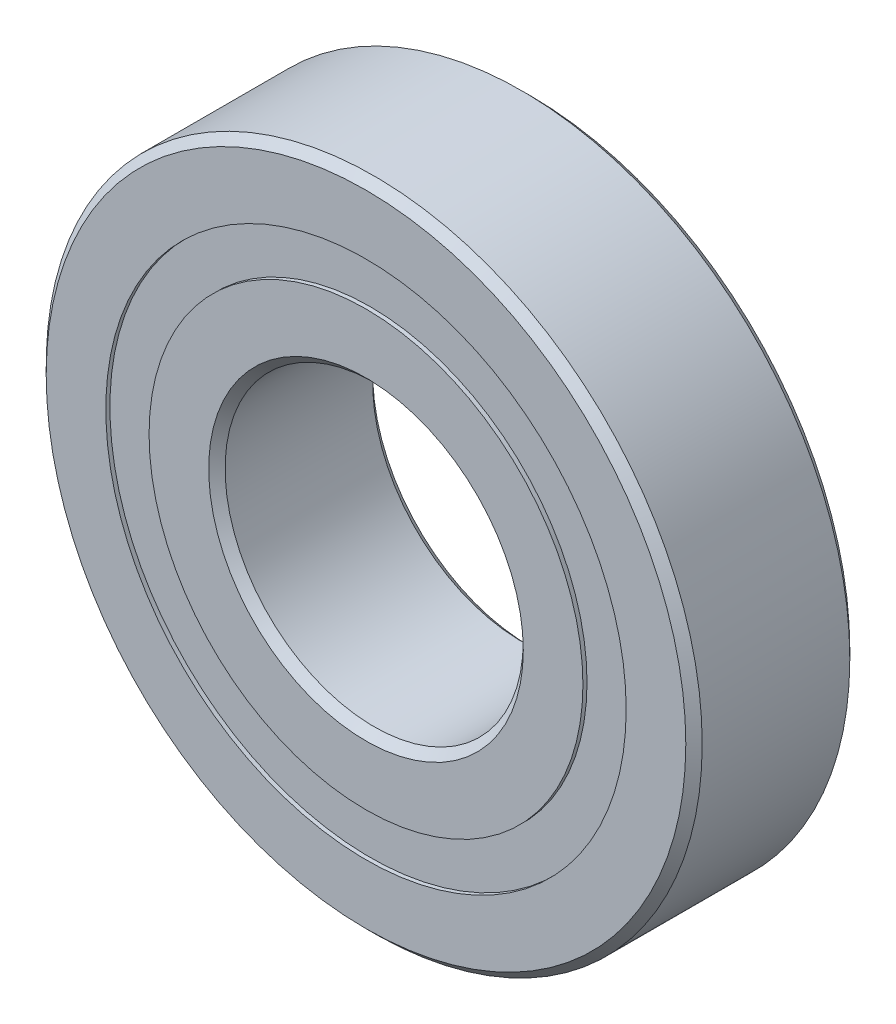
ISO-10303-21;
HEADER;
FILE_DESCRIPTION(('STEP AP214'),'2;1');
FILE_NAME('part.step','',(''),(''),'','','');
FILE_SCHEMA(('AUTOMOTIVE_DESIGN { 1 0 10303 214 1 1 1 1 }'));
ENDSEC;
DATA;
#1=APPLICATION_CONTEXT('core data for automotive mechanical design processes');
#2=APPLICATION_PROTOCOL_DEFINITION('international standard','automotive_design',2000,#1);
#3=PRODUCT_CONTEXT('',#1,'mechanical');
#4=PRODUCT('Part','Part','',(#3));
#5=PRODUCT_RELATED_PRODUCT_CATEGORY('part','',(#4));
#6=PRODUCT_DEFINITION_FORMATION('','',#4);
#7=PRODUCT_DEFINITION_CONTEXT('part definition',#1,'design');
#8=PRODUCT_DEFINITION('design','',#6,#7);
#9=PRODUCT_DEFINITION_SHAPE('','',#8);
#10=(LENGTH_UNIT() NAMED_UNIT(*) SI_UNIT(.MILLI.,.METRE.));
#11=(NAMED_UNIT(*) PLANE_ANGLE_UNIT() SI_UNIT($,.RADIAN.));
#12=(NAMED_UNIT(*) SI_UNIT($,.STERADIAN.) SOLID_ANGLE_UNIT());
#13=UNCERTAINTY_MEASURE_WITH_UNIT(LENGTH_MEASURE(1.E-05),#10,'distance_accuracy_value','');
#14=(GEOMETRIC_REPRESENTATION_CONTEXT(3) GLOBAL_UNCERTAINTY_ASSIGNED_CONTEXT((#13)) GLOBAL_UNIT_ASSIGNED_CONTEXT((#10,
#11,#12)) REPRESENTATION_CONTEXT('',''));
#15=CARTESIAN_POINT('',(0.,0.,0.));
#16=DIRECTION('',(0.,0.,1.));
#17=DIRECTION('',(1.,0.,0.));
#18=AXIS2_PLACEMENT_3D('',#15,#16,#17);
#19=CARTESIAN_POINT('',(0.,13.8513736263736,-4.14734375));
#20=DIRECTION('',(0.,0.,1.));
#21=DIRECTION('',(1.,0.,0.));
#22=AXIS2_PLACEMENT_3D('',#19,#20,#21);
#23=PLANE('',#22);
#24=CARTESIAN_POINT('',(0.,0.,-4.14734375));
#25=DIRECTION('',(0.,0.,1.));
#26=DIRECTION('',(1.,0.,0.));
#27=AXIS2_PLACEMENT_3D('',#24,#25,#26);
#28=CIRCLE('',#27,13.8513736263736);
#29=CARTESIAN_POINT('',(13.8513736263736,0.,-4.14734375));
#30=VERTEX_POINT('',#29);
#31=EDGE_CURVE('E59',#30,#30,#28,.T.);
#32=ORIENTED_EDGE('',*,*,#31,.F.);
#33=EDGE_LOOP('',(#32));
#34=FACE_BOUND('',#33,.T.);
#35=CARTESIAN_POINT('',(0.,0.,-4.14734375));
#36=DIRECTION('',(0.,0.,1.));
#37=DIRECTION('',(1.,0.,0.));
#38=AXIS2_PLACEMENT_3D('',#35,#36,#37);
#39=CIRCLE('',#38,11.5486263736264);
#40=CARTESIAN_POINT('',(11.5486263736264,0.,-4.14734375));
#41=VERTEX_POINT('',#40);
#42=EDGE_CURVE('E11',#41,#41,#39,.T.);
#43=ORIENTED_EDGE('',*,*,#42,.T.);
#44=EDGE_LOOP('',(#43));
#45=FACE_BOUND('',#44,.T.);
#46=ADVANCED_FACE('F45',(#34,#45),#23,.F.);
#47=CARTESIAN_POINT('',(0.,0.,4.365625));
#48=DIRECTION('',(0.,0.,1.));
#49=DIRECTION('',(1.,0.,0.));
#50=AXIS2_PLACEMENT_3D('',#47,#48,#49);
#51=CYLINDRICAL_SURFACE('',#50,11.5486263736264);
#52=ORIENTED_EDGE('',*,*,#42,.F.);
#53=EDGE_LOOP('',(#52));
#54=FACE_BOUND('',#53,.T.);
#55=CARTESIAN_POINT('',(0.,0.,-2.25617798111032));
#56=DIRECTION('',(0.,0.,1.));
#57=DIRECTION('',(1.,0.,0.));
#58=AXIS2_PLACEMENT_3D('',#55,#56,#57);
#59=CIRCLE('',#58,11.5486263736264);
#60=CARTESIAN_POINT('',(11.5486263736264,0.,-2.25617798111032));
#61=VERTEX_POINT('',#60);
#62=EDGE_CURVE('E51',#61,#61,#59,.T.);
#63=ORIENTED_EDGE('',*,*,#62,.T.);
#64=EDGE_LOOP('',(#63));
#65=FACE_BOUND('',#64,.T.);
#66=ADVANCED_FACE('F68',(#54,#65),#51,.F.);
#67=CARTESIAN_POINT('',(0.,13.8513736263736,-2.25617798111032));
#68=DIRECTION('',(0.,0.,-1.));
#69=DIRECTION('',(-1.,0.,0.));
#70=AXIS2_PLACEMENT_3D('',#67,#68,#69);
#71=PLANE('',#70);
#72=ORIENTED_EDGE('',*,*,#62,.F.);
#73=EDGE_LOOP('',(#72));
#74=FACE_BOUND('',#73,.T.);
#75=CARTESIAN_POINT('',(0.,0.,-2.25617798111032));
#76=DIRECTION('',(0.,0.,1.));
#77=DIRECTION('',(1.,0.,0.));
#78=AXIS2_PLACEMENT_3D('',#75,#76,#77);
#79=CIRCLE('',#78,13.8513736263736);
#80=CARTESIAN_POINT('',(13.8513736263736,0.,-2.25617798111032));
#81=VERTEX_POINT('',#80);
#82=EDGE_CURVE('E55',#81,#81,#79,.T.);
#83=ORIENTED_EDGE('',*,*,#82,.T.);
#84=EDGE_LOOP('',(#83));
#85=FACE_BOUND('',#84,.T.);
#86=ADVANCED_FACE('F72',(#74,#85),#71,.F.);
#87=CARTESIAN_POINT('',(0.,0.,4.365625));
#88=DIRECTION('',(0.,0.,1.));
#89=DIRECTION('',(1.,0.,0.));
#90=AXIS2_PLACEMENT_3D('',#87,#88,#89);
#91=CYLINDRICAL_SURFACE('',#90,13.8513736263736);
#92=ORIENTED_EDGE('',*,*,#82,.F.);
#93=EDGE_LOOP('',(#92));
#94=FACE_BOUND('',#93,.T.);
#95=ORIENTED_EDGE('',*,*,#31,.T.);
#96=EDGE_LOOP('',(#95));
#97=FACE_BOUND('',#96,.T.);
#98=ADVANCED_FACE('F65',(#94,#97),#91,.T.);
#99=CLOSED_SHELL('',(#46,#66,#86,#98));
#100=MANIFOLD_SOLID_BREP('B2',#99);
#101=CARTESIAN_POINT('',(0.,13.8513736263736,4.14734375));
#102=DIRECTION('',(0.,0.,-1.));
#103=DIRECTION('',(-1.,0.,0.));
#104=AXIS2_PLACEMENT_3D('',#101,#102,#103);
#105=PLANE('',#104);
#106=CARTESIAN_POINT('',(0.,0.,4.14734375));
#107=DIRECTION('',(0.,0.,1.));
#108=DIRECTION('',(1.,0.,0.));
#109=AXIS2_PLACEMENT_3D('',#106,#107,#108);
#110=CIRCLE('',#109,11.5486263736264);
#111=CARTESIAN_POINT('',(11.5486263736264,0.,4.14734375));
#112=VERTEX_POINT('',#111);
#113=EDGE_CURVE('E44',#112,#112,#110,.T.);
#114=ORIENTED_EDGE('',*,*,#113,.F.);
#115=EDGE_LOOP('',(#114));
#116=FACE_BOUND('',#115,.T.);
#117=CARTESIAN_POINT('',(0.,0.,4.14734375));
#118=DIRECTION('',(0.,0.,1.));
#119=DIRECTION('',(1.,0.,0.));
#120=AXIS2_PLACEMENT_3D('',#117,#118,#119);
#121=CIRCLE('',#120,13.8513736263736);
#122=CARTESIAN_POINT('',(13.8513736263736,0.,4.14734375));
#123=VERTEX_POINT('',#122);
#124=EDGE_CURVE('E126',#123,#123,#121,.T.);
#125=ORIENTED_EDGE('',*,*,#124,.T.);
#126=EDGE_LOOP('',(#125));
#127=FACE_BOUND('',#126,.T.);
#128=ADVANCED_FACE('F112',(#116,#127),#105,.F.);
#129=CARTESIAN_POINT('',(0.,0.,4.365625));
#130=DIRECTION('',(0.,0.,1.));
#131=DIRECTION('',(1.,0.,0.));
#132=AXIS2_PLACEMENT_3D('',#129,#130,#131);
#133=CYLINDRICAL_SURFACE('',#132,11.5486263736264);
#134=CARTESIAN_POINT('',(0.,0.,2.25617798111032));
#135=DIRECTION('',(0.,0.,1.));
#136=DIRECTION('',(1.,0.,0.));
#137=AXIS2_PLACEMENT_3D('',#134,#135,#136);
#138=CIRCLE('',#137,11.5486263736264);
#139=CARTESIAN_POINT('',(11.5486263736264,0.,2.25617798111032));
#140=VERTEX_POINT('',#139);
#141=EDGE_CURVE('E118',#140,#140,#138,.T.);
#142=ORIENTED_EDGE('',*,*,#141,.F.);
#143=EDGE_LOOP('',(#142));
#144=FACE_BOUND('',#143,.T.);
#145=ORIENTED_EDGE('',*,*,#113,.T.);
#146=EDGE_LOOP('',(#145));
#147=FACE_BOUND('',#146,.T.);
#148=ADVANCED_FACE('F141',(#144,#147),#133,.F.);
#149=CARTESIAN_POINT('',(0.,13.8513736263736,2.25617798111032));
#150=DIRECTION('',(0.,0.,1.));
#151=DIRECTION('',(1.,0.,0.));
#152=AXIS2_PLACEMENT_3D('',#149,#150,#151);
#153=PLANE('',#152);
#154=CARTESIAN_POINT('',(0.,0.,2.25617798111032));
#155=DIRECTION('',(0.,0.,1.));
#156=DIRECTION('',(1.,0.,0.));
#157=AXIS2_PLACEMENT_3D('',#154,#155,#156);
#158=CIRCLE('',#157,13.8513736263736);
#159=CARTESIAN_POINT('',(13.8513736263736,0.,2.25617798111032));
#160=VERTEX_POINT('',#159);
#161=EDGE_CURVE('E122',#160,#160,#158,.T.);
#162=ORIENTED_EDGE('',*,*,#161,.F.);
#163=EDGE_LOOP('',(#162));
#164=FACE_BOUND('',#163,.T.);
#165=ORIENTED_EDGE('',*,*,#141,.T.);
#166=EDGE_LOOP('',(#165));
#167=FACE_BOUND('',#166,.T.);
#168=ADVANCED_FACE('F136',(#164,#167),#153,.F.);
#169=CARTESIAN_POINT('',(0.,0.,4.365625));
#170=DIRECTION('',(0.,0.,1.));
#171=DIRECTION('',(1.,0.,0.));
#172=AXIS2_PLACEMENT_3D('',#169,#170,#171);
#173=CYLINDRICAL_SURFACE('',#172,13.8513736263736);
#174=ORIENTED_EDGE('',*,*,#124,.F.);
#175=EDGE_LOOP('',(#174));
#176=FACE_BOUND('',#175,.T.);
#177=ORIENTED_EDGE('',*,*,#161,.T.);
#178=EDGE_LOOP('',(#177));
#179=FACE_BOUND('',#178,.T.);
#180=ADVANCED_FACE('F133',(#176,#179),#173,.T.);
#181=CLOSED_SHELL('',(#128,#148,#168,#180));
#182=MANIFOLD_SOLID_BREP('B6',#181);
#183=CARTESIAN_POINT('',(-7.46487270411427,10.2745158285619,0.));
#184=DIRECTION('',(0.,0.,1.));
#185=DIRECTION('',(-0.587785252292462,0.809016994374955,0.));
#186=AXIS2_PLACEMENT_3D('',#183,#184,#185);
#187=SPHERICAL_SURFACE('',#186,2.25617798111032);
#188=CARTESIAN_POINT('',(-7.46487270411427,10.2745158285619,2.25617798111032));
#189=VERTEX_POINT('',#188);
#190=VERTEX_LOOP('',#189);
#191=FACE_BOUND('',#190,.T.);
#192=ADVANCED_FACE('F179',(#191),#187,.T.);
#193=CLOSED_SHELL('',(#192));
#194=MANIFOLD_SOLID_BREP('B39',#193);
#195=CARTESIAN_POINT('',(-12.0784177569484,3.92451582856197,0.));
#196=DIRECTION('',(0.,0.,1.));
#197=DIRECTION('',(-0.95105651629515,0.309016994374958,0.));
#198=AXIS2_PLACEMENT_3D('',#195,#196,#197);
#199=SPHERICAL_SURFACE('',#198,2.25617798111032);
#200=CARTESIAN_POINT('',(-12.0784177569484,3.92451582856197,2.25617798111032));
#201=VERTEX_POINT('',#200);
#202=VERTEX_LOOP('',#201);
#203=FACE_BOUND('',#202,.T.);
#204=ADVANCED_FACE('F199',(#203),#199,.T.);
#205=CLOSED_SHELL('',(#204));
#206=MANIFOLD_SOLID_BREP('B108',#205);
#207=CARTESIAN_POINT('',(-12.0784177569485,-3.92451582856172,0.));
#208=DIRECTION('',(0.,0.,1.));
#209=DIRECTION('',(-0.951056516295157,-0.309016994374938,0.));
#210=AXIS2_PLACEMENT_3D('',#207,#208,#209);
#211=SPHERICAL_SURFACE('',#210,2.25617798111032);
#212=CARTESIAN_POINT('',(-12.0784177569485,-3.92451582856172,2.25617798111032));
#213=VERTEX_POINT('',#212);
#214=VERTEX_LOOP('',#213);
#215=FACE_BOUND('',#214,.T.);
#216=ADVANCED_FACE('F219',(#215),#211,.T.);
#217=CLOSED_SHELL('',(#216));
#218=MANIFOLD_SOLID_BREP('B175',#217);
#219=CARTESIAN_POINT('',(-7.4648727041145,-10.2745158285618,0.));
#220=DIRECTION('',(0.,0.,1.));
#221=DIRECTION('',(-0.58778525229248,-0.809016994374942,0.));
#222=AXIS2_PLACEMENT_3D('',#219,#220,#221);
#223=SPHERICAL_SURFACE('',#222,2.25617798111032);
#224=CARTESIAN_POINT('',(-7.4648727041145,-10.2745158285618,2.25617798111032));
#225=VERTEX_POINT('',#224);
#226=VERTEX_LOOP('',#225);
#227=FACE_BOUND('',#226,.T.);
#228=ADVANCED_FACE('F239',(#227),#223,.T.);
#229=CLOSED_SHELL('',(#228));
#230=MANIFOLD_SOLID_BREP('B195',#229);
#231=CARTESIAN_POINT('',(0.,-12.7,0.));
#232=DIRECTION('',(0.,0.,1.));
#233=DIRECTION('',(0.,-1.,0.));
#234=AXIS2_PLACEMENT_3D('',#231,#232,#233);
#235=SPHERICAL_SURFACE('',#234,2.25617798111032);
#236=CARTESIAN_POINT('',(0.,-12.7,2.25617798111032));
#237=VERTEX_POINT('',#236);
#238=VERTEX_LOOP('',#237);
#239=FACE_BOUND('',#238,.T.);
#240=ADVANCED_FACE('F259',(#239),#235,.T.);
#241=CLOSED_SHELL('',(#240));
#242=MANIFOLD_SOLID_BREP('B215',#241);
#243=CARTESIAN_POINT('',(7.46487270411435,-10.2745158285619,0.));
#244=DIRECTION('',(0.,0.,1.));
#245=DIRECTION('',(0.587785252292469,-0.809016994374951,0.));
#246=AXIS2_PLACEMENT_3D('',#243,#244,#245);
#247=SPHERICAL_SURFACE('',#246,2.25617798111032);
#248=CARTESIAN_POINT('',(7.46487270411435,-10.2745158285619,2.25617798111032));
#249=VERTEX_POINT('',#248);
#250=VERTEX_LOOP('',#249);
#251=FACE_BOUND('',#250,.T.);
#252=ADVANCED_FACE('F279',(#251),#247,.T.);
#253=CLOSED_SHELL('',(#252));
#254=MANIFOLD_SOLID_BREP('B235',#253);
#255=CARTESIAN_POINT('',(12.0784177569484,-3.92451582856189,0.));
#256=DIRECTION('',(0.,0.,1.));
#257=DIRECTION('',(0.951056516295152,-0.309016994374952,0.));
#258=AXIS2_PLACEMENT_3D('',#255,#256,#257);
#259=SPHERICAL_SURFACE('',#258,2.25617798111032);
#260=CARTESIAN_POINT('',(12.0784177569484,-3.92451582856189,2.25617798111032));
#261=VERTEX_POINT('',#260);
#262=VERTEX_LOOP('',#261);
#263=FACE_BOUND('',#262,.T.);
#264=ADVANCED_FACE('F299',(#263),#259,.T.);
#265=CLOSED_SHELL('',(#264));
#266=MANIFOLD_SOLID_BREP('B255',#265);
#267=CARTESIAN_POINT('',(12.0784177569485,3.9245158285618,0.));
#268=DIRECTION('',(0.,0.,1.));
#269=DIRECTION('',(0.951056516295155,0.309016994374945,0.));
#270=AXIS2_PLACEMENT_3D('',#267,#268,#269);
#271=SPHERICAL_SURFACE('',#270,2.25617798111032);
#272=CARTESIAN_POINT('',(12.0784177569485,3.9245158285618,2.25617798111032));
#273=VERTEX_POINT('',#272);
#274=VERTEX_LOOP('',#273);
#275=FACE_BOUND('',#274,.T.);
#276=ADVANCED_FACE('F319',(#275),#271,.T.);
#277=CLOSED_SHELL('',(#276));
#278=MANIFOLD_SOLID_BREP('B275',#277);
#279=CARTESIAN_POINT('',(7.46487270411442,10.2745158285618,0.));
#280=DIRECTION('',(0.,0.,1.));
#281=DIRECTION('',(0.587785252292474,0.809016994374947,0.));
#282=AXIS2_PLACEMENT_3D('',#279,#280,#281);
#283=SPHERICAL_SURFACE('',#282,2.25617798111032);
#284=CARTESIAN_POINT('',(7.46487270411442,10.2745158285618,2.25617798111032));
#285=VERTEX_POINT('',#284);
#286=VERTEX_LOOP('',#285);
#287=FACE_BOUND('',#286,.T.);
#288=ADVANCED_FACE('F339',(#287),#283,.T.);
#289=CLOSED_SHELL('',(#288));
#290=MANIFOLD_SOLID_BREP('B295',#289);
#291=CARTESIAN_POINT('',(0.,12.7,0.));
#292=DIRECTION('',(0.,0.,1.));
#293=DIRECTION('',(0.,1.,0.));
#294=AXIS2_PLACEMENT_3D('',#291,#292,#293);
#295=SPHERICAL_SURFACE('',#294,2.25617798111032);
#296=CARTESIAN_POINT('',(0.,12.7,2.25617798111032));
#297=VERTEX_POINT('',#296);
#298=VERTEX_LOOP('',#297);
#299=FACE_BOUND('',#298,.T.);
#300=ADVANCED_FACE('F361',(#299),#295,.T.);
#301=CLOSED_SHELL('',(#300));
#302=MANIFOLD_SOLID_BREP('B315',#301);
#303=CARTESIAN_POINT('',(0.,11.5486263736264,4.365625));
#304=DIRECTION('',(0.,0.,-1.));
#305=DIRECTION('',(-1.,0.,0.));
#306=AXIS2_PLACEMENT_3D('',#303,#304,#305);
#307=PLANE('',#306);
#308=CARTESIAN_POINT('',(0.,0.,4.365625));
#309=DIRECTION('',(0.,0.,1.));
#310=DIRECTION('',(1.,0.,0.));
#311=AXIS2_PLACEMENT_3D('',#308,#309,#310);
#312=CIRCLE('',#311,8.3740625);
#313=CARTESIAN_POINT('',(8.3740625,0.,4.365625));
#314=VERTEX_POINT('',#313);
#315=EDGE_CURVE('E408',#314,#314,#312,.T.);
#316=ORIENTED_EDGE('',*,*,#315,.F.);
#317=EDGE_LOOP('',(#316));
#318=FACE_BOUND('',#317,.T.);
#319=CARTESIAN_POINT('',(0.,0.,4.365625));
#320=DIRECTION('',(0.,0.,1.));
#321=DIRECTION('',(1.,0.,0.));
#322=AXIS2_PLACEMENT_3D('',#319,#320,#321);
#323=CIRCLE('',#322,11.5486263736264);
#324=CARTESIAN_POINT('',(11.5486263736264,0.,4.365625));
#325=VERTEX_POINT('',#324);
#326=EDGE_CURVE('E360',#325,#325,#323,.T.);
#327=ORIENTED_EDGE('',*,*,#326,.T.);
#328=EDGE_LOOP('',(#327));
#329=FACE_BOUND('',#328,.T.);
#330=ADVANCED_FACE('F380',(#318,#329),#307,.F.);
#331=CARTESIAN_POINT('',(0.,0.,4.365625));
#332=DIRECTION('',(0.,0.,1.));
#333=DIRECTION('',(1.,0.,0.));
#334=AXIS2_PLACEMENT_3D('',#331,#332,#333);
#335=CYLINDRICAL_SURFACE('',#334,11.5486263736264);
#336=ORIENTED_EDGE('',*,*,#326,.F.);
#337=EDGE_LOOP('',(#336));
#338=FACE_BOUND('',#337,.T.);
#339=CARTESIAN_POINT('',(0.,0.,1.94027777777778));
#340=DIRECTION('',(0.,0.,1.));
#341=DIRECTION('',(1.,0.,0.));
#342=AXIS2_PLACEMENT_3D('',#339,#340,#341);
#343=CIRCLE('',#342,11.5486263736264);
#344=CARTESIAN_POINT('',(11.5486263736264,0.,1.94027777777778));
#345=VERTEX_POINT('',#344);
#346=EDGE_CURVE('E386',#345,#345,#343,.T.);
#347=ORIENTED_EDGE('',*,*,#346,.T.);
#348=EDGE_LOOP('',(#347));
#349=FACE_BOUND('',#348,.T.);
#350=ADVANCED_FACE('F415',(#338,#349),#335,.T.);
#351=CARTESIAN_POINT('',(0.,0.,0.));
#352=DIRECTION('',(0.,0.,1.));
#353=DIRECTION('',(1.,0.,0.));
#354=AXIS2_PLACEMENT_3D('',#351,#352,#353);
#355=TOROIDAL_SURFACE('',#354,12.7,2.25617798111031);
#356=ORIENTED_EDGE('',*,*,#346,.F.);
#357=EDGE_LOOP('',(#356));
#358=FACE_BOUND('',#357,.T.);
#359=CARTESIAN_POINT('',(0.,0.,-1.94027777777778));
#360=DIRECTION('',(0.,0.,1.));
#361=DIRECTION('',(1.,0.,0.));
#362=AXIS2_PLACEMENT_3D('',#359,#360,#361);
#363=CIRCLE('',#362,11.5486263736264);
#364=CARTESIAN_POINT('',(11.5486263736264,0.,-1.94027777777778));
#365=VERTEX_POINT('',#364);
#366=EDGE_CURVE('E390',#365,#365,#363,.T.);
#367=ORIENTED_EDGE('',*,*,#366,.T.);
#368=EDGE_LOOP('',(#367));
#369=FACE_BOUND('',#368,.T.);
#370=ADVANCED_FACE('F419',(#358,#369),#355,.F.);
#371=CARTESIAN_POINT('',(0.,0.,4.365625));
#372=DIRECTION('',(0.,0.,1.));
#373=DIRECTION('',(1.,0.,0.));
#374=AXIS2_PLACEMENT_3D('',#371,#372,#373);
#375=CYLINDRICAL_SURFACE('',#374,11.5486263736264);
#376=ORIENTED_EDGE('',*,*,#366,.F.);
#377=EDGE_LOOP('',(#376));
#378=FACE_BOUND('',#377,.T.);
#379=CARTESIAN_POINT('',(0.,0.,-4.365625));
#380=DIRECTION('',(0.,0.,1.));
#381=DIRECTION('',(1.,0.,0.));
#382=AXIS2_PLACEMENT_3D('',#379,#380,#381);
#383=CIRCLE('',#382,11.5486263736264);
#384=CARTESIAN_POINT('',(11.5486263736264,0.,-4.365625));
#385=VERTEX_POINT('',#384);
#386=EDGE_CURVE('E394',#385,#385,#383,.T.);
#387=ORIENTED_EDGE('',*,*,#386,.T.);
#388=EDGE_LOOP('',(#387));
#389=FACE_BOUND('',#388,.T.);
#390=ADVANCED_FACE('F424',(#378,#389),#375,.T.);
#391=CARTESIAN_POINT('',(0.,8.3740625,-4.365625));
#392=DIRECTION('',(0.,0.,1.));
#393=DIRECTION('',(1.,0.,0.));
#394=AXIS2_PLACEMENT_3D('',#391,#392,#393);
#395=PLANE('',#394);
#396=ORIENTED_EDGE('',*,*,#386,.F.);
#397=EDGE_LOOP('',(#396));
#398=FACE_BOUND('',#397,.T.);
#399=CARTESIAN_POINT('',(0.,0.,-4.365625));
#400=DIRECTION('',(0.,0.,1.));
#401=DIRECTION('',(1.,0.,0.));
#402=AXIS2_PLACEMENT_3D('',#399,#400,#401);
#403=CIRCLE('',#402,8.3740625);
#404=CARTESIAN_POINT('',(8.3740625,0.,-4.365625));
#405=VERTEX_POINT('',#404);
#406=EDGE_CURVE('E399',#405,#405,#403,.T.);
#407=ORIENTED_EDGE('',*,*,#406,.T.);
#408=EDGE_LOOP('',(#407));
#409=FACE_BOUND('',#408,.T.);
#410=ADVANCED_FACE('F430',(#398,#409),#395,.F.);
#411=CARTESIAN_POINT('',(0.,0.,-3.9290625));
#412=DIRECTION('',(0.,0.,-1.));
#413=DIRECTION('',(-1.,0.,0.));
#414=AXIS2_PLACEMENT_3D('',#411,#412,#413);
#415=CONICAL_SURFACE('',#414,7.9375,0.785398163397446);
#416=ORIENTED_EDGE('',*,*,#406,.F.);
#417=EDGE_LOOP('',(#416));
#418=FACE_BOUND('',#417,.T.);
#419=CARTESIAN_POINT('',(0.,0.,-3.9290625));
#420=DIRECTION('',(0.,0.,1.));
#421=DIRECTION('',(1.,0.,0.));
#422=AXIS2_PLACEMENT_3D('',#419,#420,#421);
#423=CIRCLE('',#422,7.9375);
#424=CARTESIAN_POINT('',(7.9375,0.,-3.9290625));
#425=VERTEX_POINT('',#424);
#426=EDGE_CURVE('E402',#425,#425,#423,.T.);
#427=ORIENTED_EDGE('',*,*,#426,.T.);
#428=EDGE_LOOP('',(#427));
#429=FACE_BOUND('',#428,.T.);
#430=ADVANCED_FACE('F434',(#418,#429),#415,.F.);
#431=CARTESIAN_POINT('',(0.,0.,4.365625));
#432=DIRECTION('',(0.,0.,1.));
#433=DIRECTION('',(1.,0.,0.));
#434=AXIS2_PLACEMENT_3D('',#431,#432,#433);
#435=CYLINDRICAL_SURFACE('',#434,7.9375);
#436=ORIENTED_EDGE('',*,*,#426,.F.);
#437=EDGE_LOOP('',(#436));
#438=FACE_BOUND('',#437,.T.);
#439=CARTESIAN_POINT('',(0.,0.,3.9290625));
#440=DIRECTION('',(0.,0.,1.));
#441=DIRECTION('',(1.,0.,0.));
#442=AXIS2_PLACEMENT_3D('',#439,#440,#441);
#443=CIRCLE('',#442,7.9375);
#444=CARTESIAN_POINT('',(7.9375,0.,3.9290625));
#445=VERTEX_POINT('',#444);
#446=EDGE_CURVE('E405',#445,#445,#443,.T.);
#447=ORIENTED_EDGE('',*,*,#446,.T.);
#448=EDGE_LOOP('',(#447));
#449=FACE_BOUND('',#448,.T.);
#450=ADVANCED_FACE('F438',(#438,#449),#435,.F.);
#451=CARTESIAN_POINT('',(0.,0.,4.365625));
#452=DIRECTION('',(0.,0.,1.));
#453=DIRECTION('',(1.,0.,0.));
#454=AXIS2_PLACEMENT_3D('',#451,#452,#453);
#455=CONICAL_SURFACE('',#454,8.3740625,0.785398163397447);
#456=ORIENTED_EDGE('',*,*,#446,.F.);
#457=EDGE_LOOP('',(#456));
#458=FACE_BOUND('',#457,.T.);
#459=ORIENTED_EDGE('',*,*,#315,.T.);
#460=EDGE_LOOP('',(#459));
#461=FACE_BOUND('',#460,.T.);
#462=ADVANCED_FACE('F412',(#458,#461),#455,.F.);
#463=CLOSED_SHELL('',(#330,#350,#370,#390,#410,#430,#450,#462));
#464=MANIFOLD_SOLID_BREP('B335',#463);
#465=CARTESIAN_POINT('',(0.,0.,3.9290625));
#466=DIRECTION('',(0.,0.,-1.));
#467=DIRECTION('',(-1.,0.,0.));
#468=AXIS2_PLACEMENT_3D('',#465,#466,#467);
#469=CONICAL_SURFACE('',#468,17.4625,0.785398163397445);
#470=CARTESIAN_POINT('',(0.,0.,4.365625));
#471=DIRECTION('',(0.,0.,1.));
#472=DIRECTION('',(1.,0.,0.));
#473=AXIS2_PLACEMENT_3D('',#470,#471,#472);
#474=CIRCLE('',#473,17.0259375);
#475=CARTESIAN_POINT('',(17.0259375,0.,4.365625));
#476=VERTEX_POINT('',#475);
#477=EDGE_CURVE('E529',#476,#476,#474,.T.);
#478=ORIENTED_EDGE('',*,*,#477,.F.);
#479=EDGE_LOOP('',(#478));
#480=FACE_BOUND('',#479,.T.);
#481=CARTESIAN_POINT('',(0.,0.,3.9290625));
#482=DIRECTION('',(0.,0.,1.));
#483=DIRECTION('',(1.,0.,0.));
#484=AXIS2_PLACEMENT_3D('',#481,#482,#483);
#485=CIRCLE('',#484,17.4625);
#486=CARTESIAN_POINT('',(17.4625,0.,3.9290625));
#487=VERTEX_POINT('',#486);
#488=EDGE_CURVE('E379',#487,#487,#485,.T.);
#489=ORIENTED_EDGE('',*,*,#488,.T.);
#490=EDGE_LOOP('',(#489));
#491=FACE_BOUND('',#490,.T.);
#492=ADVANCED_FACE('F501',(#480,#491),#469,.T.);
#493=CARTESIAN_POINT('',(0.,0.,4.365625));
#494=DIRECTION('',(0.,0.,1.));
#495=DIRECTION('',(1.,0.,0.));
#496=AXIS2_PLACEMENT_3D('',#493,#494,#495);
#497=CYLINDRICAL_SURFACE('',#496,17.4625);
#498=ORIENTED_EDGE('',*,*,#488,.F.);
#499=EDGE_LOOP('',(#498));
#500=FACE_BOUND('',#499,.T.);
#501=CARTESIAN_POINT('',(0.,0.,-3.9290625));
#502=DIRECTION('',(0.,0.,1.));
#503=DIRECTION('',(1.,0.,0.));
#504=AXIS2_PLACEMENT_3D('',#501,#502,#503);
#505=CIRCLE('',#504,17.4625);
#506=CARTESIAN_POINT('',(17.4625,0.,-3.9290625));
#507=VERTEX_POINT('',#506);
#508=EDGE_CURVE('E507',#507,#507,#505,.T.);
#509=ORIENTED_EDGE('',*,*,#508,.T.);
#510=EDGE_LOOP('',(#509));
#511=FACE_BOUND('',#510,.T.);
#512=ADVANCED_FACE('F536',(#500,#511),#497,.T.);
#513=CARTESIAN_POINT('',(0.,0.,-4.365625));
#514=DIRECTION('',(0.,0.,1.));
#515=DIRECTION('',(1.,0.,0.));
#516=AXIS2_PLACEMENT_3D('',#513,#514,#515);
#517=CONICAL_SURFACE('',#516,17.0259375,0.785398163397446);
#518=ORIENTED_EDGE('',*,*,#508,.F.);
#519=EDGE_LOOP('',(#518));
#520=FACE_BOUND('',#519,.T.);
#521=CARTESIAN_POINT('',(0.,0.,-4.365625));
#522=DIRECTION('',(0.,0.,1.));
#523=DIRECTION('',(1.,0.,0.));
#524=AXIS2_PLACEMENT_3D('',#521,#522,#523);
#525=CIRCLE('',#524,17.0259375);
#526=CARTESIAN_POINT('',(17.0259375,0.,-4.365625));
#527=VERTEX_POINT('',#526);
#528=EDGE_CURVE('E511',#527,#527,#525,.T.);
#529=ORIENTED_EDGE('',*,*,#528,.T.);
#530=EDGE_LOOP('',(#529));
#531=FACE_BOUND('',#530,.T.);
#532=ADVANCED_FACE('F540',(#520,#531),#517,.T.);
#533=CARTESIAN_POINT('',(0.,17.0259375,-4.365625));
#534=DIRECTION('',(0.,0.,1.));
#535=DIRECTION('',(1.,0.,0.));
#536=AXIS2_PLACEMENT_3D('',#533,#534,#535);
#537=PLANE('',#536);
#538=ORIENTED_EDGE('',*,*,#528,.F.);
#539=EDGE_LOOP('',(#538));
#540=FACE_BOUND('',#539,.T.);
#541=CARTESIAN_POINT('',(0.,0.,-4.365625));
#542=DIRECTION('',(0.,0.,1.));
#543=DIRECTION('',(1.,0.,0.));
#544=AXIS2_PLACEMENT_3D('',#541,#542,#543);
#545=CIRCLE('',#544,13.8513736263736);
#546=CARTESIAN_POINT('',(13.8513736263736,0.,-4.365625));
#547=VERTEX_POINT('',#546);
#548=EDGE_CURVE('E515',#547,#547,#545,.T.);
#549=ORIENTED_EDGE('',*,*,#548,.T.);
#550=EDGE_LOOP('',(#549));
#551=FACE_BOUND('',#550,.T.);
#552=ADVANCED_FACE('F545',(#540,#551),#537,.F.);
#553=CARTESIAN_POINT('',(0.,0.,4.365625));
#554=DIRECTION('',(0.,0.,1.));
#555=DIRECTION('',(1.,0.,0.));
#556=AXIS2_PLACEMENT_3D('',#553,#554,#555);
#557=CYLINDRICAL_SURFACE('',#556,13.8513736263736);
#558=ORIENTED_EDGE('',*,*,#548,.F.);
#559=EDGE_LOOP('',(#558));
#560=FACE_BOUND('',#559,.T.);
#561=CARTESIAN_POINT('',(0.,0.,-1.94027777777778));
#562=DIRECTION('',(0.,0.,1.));
#563=DIRECTION('',(1.,0.,0.));
#564=AXIS2_PLACEMENT_3D('',#561,#562,#563);
#565=CIRCLE('',#564,13.8513736263736);
#566=CARTESIAN_POINT('',(13.8513736263736,0.,-1.94027777777778));
#567=VERTEX_POINT('',#566);
#568=EDGE_CURVE('E520',#567,#567,#565,.T.);
#569=ORIENTED_EDGE('',*,*,#568,.T.);
#570=EDGE_LOOP('',(#569));
#571=FACE_BOUND('',#570,.T.);
#572=ADVANCED_FACE('F551',(#560,#571),#557,.F.);
#573=CARTESIAN_POINT('',(0.,0.,0.));
#574=DIRECTION('',(0.,0.,1.));
#575=DIRECTION('',(1.,0.,0.));
#576=AXIS2_PLACEMENT_3D('',#573,#574,#575);
#577=TOROIDAL_SURFACE('',#576,12.7,2.25617798111032);
#578=ORIENTED_EDGE('',*,*,#568,.F.);
#579=EDGE_LOOP('',(#578));
#580=FACE_BOUND('',#579,.T.);
#581=CARTESIAN_POINT('',(0.,0.,1.94027777777778));
#582=DIRECTION('',(0.,0.,1.));
#583=DIRECTION('',(1.,0.,0.));
#584=AXIS2_PLACEMENT_3D('',#581,#582,#583);
#585=CIRCLE('',#584,13.8513736263736);
#586=CARTESIAN_POINT('',(13.8513736263736,0.,1.94027777777778));
#587=VERTEX_POINT('',#586);
#588=EDGE_CURVE('E523',#587,#587,#585,.T.);
#589=ORIENTED_EDGE('',*,*,#588,.T.);
#590=EDGE_LOOP('',(#589));
#591=FACE_BOUND('',#590,.T.);
#592=ADVANCED_FACE('F555',(#580,#591),#577,.F.);
#593=CARTESIAN_POINT('',(0.,0.,4.365625));
#594=DIRECTION('',(0.,0.,1.));
#595=DIRECTION('',(1.,0.,0.));
#596=AXIS2_PLACEMENT_3D('',#593,#594,#595);
#597=CYLINDRICAL_SURFACE('',#596,13.8513736263736);
#598=ORIENTED_EDGE('',*,*,#588,.F.);
#599=EDGE_LOOP('',(#598));
#600=FACE_BOUND('',#599,.T.);
#601=CARTESIAN_POINT('',(0.,0.,4.365625));
#602=DIRECTION('',(0.,0.,1.));
#603=DIRECTION('',(1.,0.,0.));
#604=AXIS2_PLACEMENT_3D('',#601,#602,#603);
#605=CIRCLE('',#604,13.8513736263736);
#606=CARTESIAN_POINT('',(13.8513736263736,0.,4.365625));
#607=VERTEX_POINT('',#606);
#608=EDGE_CURVE('E526',#607,#607,#605,.T.);
#609=ORIENTED_EDGE('',*,*,#608,.T.);
#610=EDGE_LOOP('',(#609));
#611=FACE_BOUND('',#610,.T.);
#612=ADVANCED_FACE('F559',(#600,#611),#597,.F.);
#613=CARTESIAN_POINT('',(0.,17.0259375,4.365625));
#614=DIRECTION('',(0.,0.,-1.));
#615=DIRECTION('',(-1.,0.,0.));
#616=AXIS2_PLACEMENT_3D('',#613,#614,#615);
#617=PLANE('',#616);
#618=ORIENTED_EDGE('',*,*,#608,.F.);
#619=EDGE_LOOP('',(#618));
#620=FACE_BOUND('',#619,.T.);
#621=ORIENTED_EDGE('',*,*,#477,.T.);
#622=EDGE_LOOP('',(#621));
#623=FACE_BOUND('',#622,.T.);
#624=ADVANCED_FACE('F533',(#620,#623),#617,.F.);
#625=CLOSED_SHELL('',(#492,#512,#532,#552,#572,#592,#612,#624));
#626=MANIFOLD_SOLID_BREP('B355',#625);
#627=ADVANCED_BREP_SHAPE_REPRESENTATION('',(#18,#100,#182,#194,#206,#218,#230,#242,#254,#266,
#278,#290,#302,#464,#626),#14);
#628=SHAPE_DEFINITION_REPRESENTATION(#9,#627);
ENDSEC;
END-ISO-10303-21;
